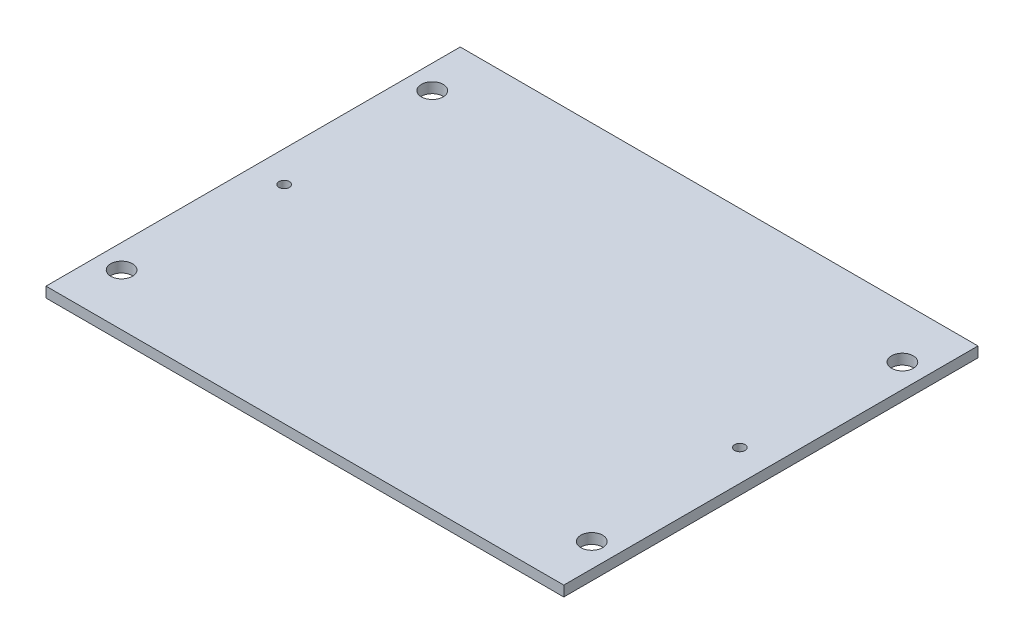
ISO-10303-21;
HEADER;
FILE_DESCRIPTION(('STEP AP214'),'2;1');
FILE_NAME('part.step','',(''),(''),'','','');
FILE_SCHEMA(('AUTOMOTIVE_DESIGN { 1 0 10303 214 1 1 1 1 }'));
ENDSEC;
DATA;
#1=APPLICATION_CONTEXT('core data for automotive mechanical design processes');
#2=APPLICATION_PROTOCOL_DEFINITION('international standard','automotive_design',2000,#1);
#3=PRODUCT_CONTEXT('',#1,'mechanical');
#4=PRODUCT('Part','Part','',(#3));
#5=PRODUCT_RELATED_PRODUCT_CATEGORY('part','',(#4));
#6=PRODUCT_DEFINITION_FORMATION('','',#4);
#7=PRODUCT_DEFINITION_CONTEXT('part definition',#1,'design');
#8=PRODUCT_DEFINITION('design','',#6,#7);
#9=PRODUCT_DEFINITION_SHAPE('','',#8);
#10=(LENGTH_UNIT() NAMED_UNIT(*) SI_UNIT(.MILLI.,.METRE.));
#11=(NAMED_UNIT(*) PLANE_ANGLE_UNIT() SI_UNIT($,.RADIAN.));
#12=(NAMED_UNIT(*) SI_UNIT($,.STERADIAN.) SOLID_ANGLE_UNIT());
#13=UNCERTAINTY_MEASURE_WITH_UNIT(LENGTH_MEASURE(1.E-05),#10,'distance_accuracy_value','');
#14=(GEOMETRIC_REPRESENTATION_CONTEXT(3) GLOBAL_UNCERTAINTY_ASSIGNED_CONTEXT((#13)) GLOBAL_UNIT_ASSIGNED_CONTEXT((#10,
#11,#12)) REPRESENTATION_CONTEXT('',''));
#15=CARTESIAN_POINT('',(0.,0.,0.));
#16=DIRECTION('',(0.,0.,1.));
#17=DIRECTION('',(1.,0.,0.));
#18=AXIS2_PLACEMENT_3D('',#15,#16,#17);
#19=CARTESIAN_POINT('',(0.,10.,0.));
#20=DIRECTION('',(0.,-1.,0.));
#21=DIRECTION('',(0.,0.,-1.));
#22=AXIS2_PLACEMENT_3D('',#19,#20,#21);
#23=PLANE('',#22);
#24=DIRECTION('',(0.,0.,-1.));
#25=VECTOR('',#24,1.);
#26=CARTESIAN_POINT('',(250.,10.,200.));
#27=LINE('',#26,#25);
#28=CARTESIAN_POINT('',(250.,10.,200.));
#29=VERTEX_POINT('',#28);
#30=CARTESIAN_POINT('',(250.,10.,-200.));
#31=VERTEX_POINT('',#30);
#32=EDGE_CURVE('E89',#29,#31,#27,.T.);
#33=ORIENTED_EDGE('',*,*,#32,.T.);
#34=DIRECTION('',(-1.,0.,0.));
#35=VECTOR('',#34,1.);
#36=CARTESIAN_POINT('',(-250.,10.,-200.));
#37=LINE('',#36,#35);
#38=CARTESIAN_POINT('',(-250.,10.,-200.));
#39=VERTEX_POINT('',#38);
#40=EDGE_CURVE('E84',#31,#39,#37,.T.);
#41=ORIENTED_EDGE('',*,*,#40,.T.);
#42=DIRECTION('',(0.,0.,1.));
#43=VECTOR('',#42,1.);
#44=CARTESIAN_POINT('',(-250.,10.,200.));
#45=LINE('',#44,#43);
#46=CARTESIAN_POINT('',(-250.,10.,200.));
#47=VERTEX_POINT('',#46);
#48=EDGE_CURVE('E87',#39,#47,#45,.T.);
#49=ORIENTED_EDGE('',*,*,#48,.T.);
#50=DIRECTION('',(1.,0.,0.));
#51=VECTOR('',#50,1.);
#52=CARTESIAN_POINT('',(-250.,10.,200.));
#53=LINE('',#52,#51);
#54=EDGE_CURVE('E54',#47,#29,#53,.T.);
#55=ORIENTED_EDGE('',*,*,#54,.T.);
#56=EDGE_LOOP('',(#33,#41,#49,#55));
#57=FACE_BOUND('',#56,.T.);
#58=CARTESIAN_POINT('',(-227.,10.,-150.));
#59=DIRECTION('',(0.,1.,0.));
#60=DIRECTION('',(0.,0.,1.));
#61=AXIS2_PLACEMENT_3D('',#58,#59,#60);
#62=CIRCLE('',#61,10.5);
#63=CARTESIAN_POINT('',(-227.,10.,-139.5));
#64=VERTEX_POINT('',#63);
#65=EDGE_CURVE('E104',#64,#64,#62,.T.);
#66=ORIENTED_EDGE('',*,*,#65,.F.);
#67=EDGE_LOOP('',(#66));
#68=FACE_BOUND('',#67,.T.);
#69=CARTESIAN_POINT('',(-227.,10.,150.));
#70=DIRECTION('',(0.,1.,0.));
#71=DIRECTION('',(0.,0.,1.));
#72=AXIS2_PLACEMENT_3D('',#69,#70,#71);
#73=CIRCLE('',#72,10.5);
#74=CARTESIAN_POINT('',(-227.,10.,160.5));
#75=VERTEX_POINT('',#74);
#76=EDGE_CURVE('E119',#75,#75,#73,.T.);
#77=ORIENTED_EDGE('',*,*,#76,.F.);
#78=EDGE_LOOP('',(#77));
#79=FACE_BOUND('',#78,.T.);
#80=CARTESIAN_POINT('',(227.,10.,150.));
#81=DIRECTION('',(0.,1.,0.));
#82=DIRECTION('',(0.,0.,1.));
#83=AXIS2_PLACEMENT_3D('',#80,#81,#82);
#84=CIRCLE('',#83,10.5);
#85=CARTESIAN_POINT('',(227.,10.,160.5));
#86=VERTEX_POINT('',#85);
#87=EDGE_CURVE('E125',#86,#86,#84,.T.);
#88=ORIENTED_EDGE('',*,*,#87,.F.);
#89=EDGE_LOOP('',(#88));
#90=FACE_BOUND('',#89,.T.);
#91=CARTESIAN_POINT('',(227.,10.,-150.));
#92=DIRECTION('',(0.,1.,0.));
#93=DIRECTION('',(0.,0.,1.));
#94=AXIS2_PLACEMENT_3D('',#91,#92,#93);
#95=CIRCLE('',#94,10.5);
#96=CARTESIAN_POINT('',(227.,10.,-139.5));
#97=VERTEX_POINT('',#96);
#98=EDGE_CURVE('E131',#97,#97,#95,.T.);
#99=ORIENTED_EDGE('',*,*,#98,.F.);
#100=EDGE_LOOP('',(#99));
#101=FACE_BOUND('',#100,.T.);
#102=CARTESIAN_POINT('',(-220.,10.,0.));
#103=DIRECTION('',(0.,1.,0.));
#104=DIRECTION('',(0.,0.,1.));
#105=AXIS2_PLACEMENT_3D('',#102,#103,#104);
#106=CIRCLE('',#105,4.99999999999999);
#107=CARTESIAN_POINT('',(-220.,10.,4.99999999999999));
#108=VERTEX_POINT('',#107);
#109=EDGE_CURVE('E137',#108,#108,#106,.T.);
#110=ORIENTED_EDGE('',*,*,#109,.F.);
#111=EDGE_LOOP('',(#110));
#112=FACE_BOUND('',#111,.T.);
#113=CARTESIAN_POINT('',(220.,10.,0.));
#114=DIRECTION('',(0.,1.,0.));
#115=DIRECTION('',(0.,0.,1.));
#116=AXIS2_PLACEMENT_3D('',#113,#114,#115);
#117=CIRCLE('',#116,4.99999999999999);
#118=CARTESIAN_POINT('',(220.,10.,4.99999999999999));
#119=VERTEX_POINT('',#118);
#120=EDGE_CURVE('E143',#119,#119,#117,.T.);
#121=ORIENTED_EDGE('',*,*,#120,.F.);
#122=EDGE_LOOP('',(#121));
#123=FACE_BOUND('',#122,.T.);
#124=ADVANCED_FACE('F37',(#57,#68,#79,#90,#101,#112,#123),#23,.F.);
#125=CARTESIAN_POINT('',(0.,0.,0.));
#126=DIRECTION('',(0.,-1.,0.));
#127=DIRECTION('',(0.,0.,-1.));
#128=AXIS2_PLACEMENT_3D('',#125,#126,#127);
#129=PLANE('',#128);
#130=CARTESIAN_POINT('',(-220.,0.,0.));
#131=DIRECTION('',(0.,1.,0.));
#132=DIRECTION('',(0.,0.,1.));
#133=AXIS2_PLACEMENT_3D('',#130,#131,#132);
#134=CIRCLE('',#133,4.99999999999999);
#135=CARTESIAN_POINT('',(-220.,0.,4.99999999999999));
#136=VERTEX_POINT('',#135);
#137=EDGE_CURVE('E140',#136,#136,#134,.T.);
#138=ORIENTED_EDGE('',*,*,#137,.T.);
#139=EDGE_LOOP('',(#138));
#140=FACE_BOUND('',#139,.T.);
#141=CARTESIAN_POINT('',(227.,0.,150.));
#142=DIRECTION('',(0.,1.,0.));
#143=DIRECTION('',(0.,0.,1.));
#144=AXIS2_PLACEMENT_3D('',#141,#142,#143);
#145=CIRCLE('',#144,10.5);
#146=CARTESIAN_POINT('',(227.,0.,160.5));
#147=VERTEX_POINT('',#146);
#148=EDGE_CURVE('E128',#147,#147,#145,.T.);
#149=ORIENTED_EDGE('',*,*,#148,.T.);
#150=EDGE_LOOP('',(#149));
#151=FACE_BOUND('',#150,.T.);
#152=CARTESIAN_POINT('',(-227.,0.,-150.));
#153=DIRECTION('',(0.,1.,0.));
#154=DIRECTION('',(0.,0.,1.));
#155=AXIS2_PLACEMENT_3D('',#152,#153,#154);
#156=CIRCLE('',#155,10.5);
#157=CARTESIAN_POINT('',(-227.,0.,-139.5));
#158=VERTEX_POINT('',#157);
#159=EDGE_CURVE('E116',#158,#158,#156,.T.);
#160=ORIENTED_EDGE('',*,*,#159,.T.);
#161=EDGE_LOOP('',(#160));
#162=FACE_BOUND('',#161,.T.);
#163=DIRECTION('',(0.,0.,-1.));
#164=VECTOR('',#163,1.);
#165=CARTESIAN_POINT('',(250.,0.,200.));
#166=LINE('',#165,#164);
#167=CARTESIAN_POINT('',(250.,0.,200.));
#168=VERTEX_POINT('',#167);
#169=CARTESIAN_POINT('',(250.,0.,-200.));
#170=VERTEX_POINT('',#169);
#171=EDGE_CURVE('E101',#168,#170,#166,.T.);
#172=ORIENTED_EDGE('',*,*,#171,.F.);
#173=DIRECTION('',(1.,0.,0.));
#174=VECTOR('',#173,1.);
#175=CARTESIAN_POINT('',(-250.,0.,200.));
#176=LINE('',#175,#174);
#177=CARTESIAN_POINT('',(-250.,0.,200.));
#178=VERTEX_POINT('',#177);
#179=EDGE_CURVE('E77',#178,#168,#176,.T.);
#180=ORIENTED_EDGE('',*,*,#179,.F.);
#181=DIRECTION('',(0.,0.,1.));
#182=VECTOR('',#181,1.);
#183=CARTESIAN_POINT('',(-250.,0.,200.));
#184=LINE('',#183,#182);
#185=CARTESIAN_POINT('',(-250.,0.,-200.));
#186=VERTEX_POINT('',#185);
#187=EDGE_CURVE('E71',#186,#178,#184,.T.);
#188=ORIENTED_EDGE('',*,*,#187,.F.);
#189=DIRECTION('',(-1.,0.,0.));
#190=VECTOR('',#189,1.);
#191=CARTESIAN_POINT('',(-250.,0.,-200.));
#192=LINE('',#191,#190);
#193=EDGE_CURVE('E93',#170,#186,#192,.T.);
#194=ORIENTED_EDGE('',*,*,#193,.F.);
#195=EDGE_LOOP('',(#172,#180,#188,#194));
#196=FACE_BOUND('',#195,.T.);
#197=CARTESIAN_POINT('',(-227.,0.,150.));
#198=DIRECTION('',(0.,1.,0.));
#199=DIRECTION('',(0.,0.,1.));
#200=AXIS2_PLACEMENT_3D('',#197,#198,#199);
#201=CIRCLE('',#200,10.5);
#202=CARTESIAN_POINT('',(-227.,0.,160.5));
#203=VERTEX_POINT('',#202);
#204=EDGE_CURVE('E122',#203,#203,#201,.T.);
#205=ORIENTED_EDGE('',*,*,#204,.T.);
#206=EDGE_LOOP('',(#205));
#207=FACE_BOUND('',#206,.T.);
#208=CARTESIAN_POINT('',(227.,0.,-150.));
#209=DIRECTION('',(0.,1.,0.));
#210=DIRECTION('',(0.,0.,1.));
#211=AXIS2_PLACEMENT_3D('',#208,#209,#210);
#212=CIRCLE('',#211,10.5);
#213=CARTESIAN_POINT('',(227.,0.,-139.5));
#214=VERTEX_POINT('',#213);
#215=EDGE_CURVE('E134',#214,#214,#212,.T.);
#216=ORIENTED_EDGE('',*,*,#215,.T.);
#217=EDGE_LOOP('',(#216));
#218=FACE_BOUND('',#217,.T.);
#219=CARTESIAN_POINT('',(220.,0.,0.));
#220=DIRECTION('',(0.,1.,0.));
#221=DIRECTION('',(0.,0.,1.));
#222=AXIS2_PLACEMENT_3D('',#219,#220,#221);
#223=CIRCLE('',#222,4.99999999999999);
#224=CARTESIAN_POINT('',(220.,0.,4.99999999999999));
#225=VERTEX_POINT('',#224);
#226=EDGE_CURVE('E146',#225,#225,#223,.T.);
#227=ORIENTED_EDGE('',*,*,#226,.T.);
#228=EDGE_LOOP('',(#227));
#229=FACE_BOUND('',#228,.T.);
#230=ADVANCED_FACE('F112',(#140,#151,#162,#196,#207,#218,#229),#129,.T.);
#231=CARTESIAN_POINT('',(250.,10.,200.));
#232=DIRECTION('',(-1.,0.,0.));
#233=DIRECTION('',(0.,0.,1.));
#234=AXIS2_PLACEMENT_3D('',#231,#232,#233);
#235=PLANE('',#234);
#236=ORIENTED_EDGE('',*,*,#171,.T.);
#237=DIRECTION('',(0.,-1.,0.));
#238=VECTOR('',#237,1.);
#239=CARTESIAN_POINT('',(250.,10.,-200.));
#240=LINE('',#239,#238);
#241=EDGE_CURVE('E11',#31,#170,#240,.T.);
#242=ORIENTED_EDGE('',*,*,#241,.F.);
#243=ORIENTED_EDGE('',*,*,#32,.F.);
#244=DIRECTION('',(0.,-1.,0.));
#245=VECTOR('',#244,1.);
#246=CARTESIAN_POINT('',(250.,10.,200.));
#247=LINE('',#246,#245);
#248=EDGE_CURVE('E97',#29,#168,#247,.T.);
#249=ORIENTED_EDGE('',*,*,#248,.T.);
#250=EDGE_LOOP('',(#236,#242,#243,#249));
#251=FACE_BOUND('',#250,.T.);
#252=ADVANCED_FACE('F39',(#251),#235,.F.);
#253=CARTESIAN_POINT('',(-250.,10.,-200.));
#254=DIRECTION('',(0.,0.,1.));
#255=DIRECTION('',(1.,0.,0.));
#256=AXIS2_PLACEMENT_3D('',#253,#254,#255);
#257=PLANE('',#256);
#258=ORIENTED_EDGE('',*,*,#193,.T.);
#259=DIRECTION('',(0.,-1.,0.));
#260=VECTOR('',#259,1.);
#261=CARTESIAN_POINT('',(-250.,10.,-200.));
#262=LINE('',#261,#260);
#263=EDGE_CURVE('E46',#39,#186,#262,.T.);
#264=ORIENTED_EDGE('',*,*,#263,.F.);
#265=ORIENTED_EDGE('',*,*,#40,.F.);
#266=ORIENTED_EDGE('',*,*,#241,.T.);
#267=EDGE_LOOP('',(#258,#264,#265,#266));
#268=FACE_BOUND('',#267,.T.);
#269=ADVANCED_FACE('F92',(#268),#257,.F.);
#270=CARTESIAN_POINT('',(-250.,10.,200.));
#271=DIRECTION('',(1.,0.,0.));
#272=DIRECTION('',(0.,0.,-1.));
#273=AXIS2_PLACEMENT_3D('',#270,#271,#272);
#274=PLANE('',#273);
#275=ORIENTED_EDGE('',*,*,#187,.T.);
#276=DIRECTION('',(0.,-1.,0.));
#277=VECTOR('',#276,1.);
#278=CARTESIAN_POINT('',(-250.,10.,200.));
#279=LINE('',#278,#277);
#280=EDGE_CURVE('E94',#47,#178,#279,.T.);
#281=ORIENTED_EDGE('',*,*,#280,.F.);
#282=ORIENTED_EDGE('',*,*,#48,.F.);
#283=ORIENTED_EDGE('',*,*,#263,.T.);
#284=EDGE_LOOP('',(#275,#281,#282,#283));
#285=FACE_BOUND('',#284,.T.);
#286=ADVANCED_FACE('F95',(#285),#274,.F.);
#287=CARTESIAN_POINT('',(-250.,10.,200.));
#288=DIRECTION('',(0.,0.,-1.));
#289=DIRECTION('',(-1.,0.,0.));
#290=AXIS2_PLACEMENT_3D('',#287,#288,#289);
#291=PLANE('',#290);
#292=ORIENTED_EDGE('',*,*,#179,.T.);
#293=ORIENTED_EDGE('',*,*,#248,.F.);
#294=ORIENTED_EDGE('',*,*,#54,.F.);
#295=ORIENTED_EDGE('',*,*,#280,.T.);
#296=EDGE_LOOP('',(#292,#293,#294,#295));
#297=FACE_BOUND('',#296,.T.);
#298=ADVANCED_FACE('F109',(#297),#291,.F.);
#299=CARTESIAN_POINT('',(-227.,10.,-150.));
#300=DIRECTION('',(0.,-1.,0.));
#301=DIRECTION('',(0.,0.,-1.));
#302=AXIS2_PLACEMENT_3D('',#299,#300,#301);
#303=CYLINDRICAL_SURFACE('',#302,10.5);
#304=ORIENTED_EDGE('',*,*,#65,.T.);
#305=EDGE_LOOP('',(#304));
#306=FACE_BOUND('',#305,.T.);
#307=ORIENTED_EDGE('',*,*,#159,.F.);
#308=EDGE_LOOP('',(#307));
#309=FACE_BOUND('',#308,.T.);
#310=ADVANCED_FACE('F163',(#306,#309),#303,.F.);
#311=CARTESIAN_POINT('',(-227.,10.,150.));
#312=DIRECTION('',(0.,-1.,0.));
#313=DIRECTION('',(0.,0.,-1.));
#314=AXIS2_PLACEMENT_3D('',#311,#312,#313);
#315=CYLINDRICAL_SURFACE('',#314,10.5);
#316=ORIENTED_EDGE('',*,*,#76,.T.);
#317=EDGE_LOOP('',(#316));
#318=FACE_BOUND('',#317,.T.);
#319=ORIENTED_EDGE('',*,*,#204,.F.);
#320=EDGE_LOOP('',(#319));
#321=FACE_BOUND('',#320,.T.);
#322=ADVANCED_FACE('F209',(#318,#321),#315,.F.);
#323=CARTESIAN_POINT('',(227.,10.,150.));
#324=DIRECTION('',(0.,-1.,0.));
#325=DIRECTION('',(0.,0.,-1.));
#326=AXIS2_PLACEMENT_3D('',#323,#324,#325);
#327=CYLINDRICAL_SURFACE('',#326,10.5);
#328=ORIENTED_EDGE('',*,*,#87,.T.);
#329=EDGE_LOOP('',(#328));
#330=FACE_BOUND('',#329,.T.);
#331=ORIENTED_EDGE('',*,*,#148,.F.);
#332=EDGE_LOOP('',(#331));
#333=FACE_BOUND('',#332,.T.);
#334=ADVANCED_FACE('F217',(#330,#333),#327,.F.);
#335=CARTESIAN_POINT('',(227.,10.,-150.));
#336=DIRECTION('',(0.,-1.,0.));
#337=DIRECTION('',(0.,0.,-1.));
#338=AXIS2_PLACEMENT_3D('',#335,#336,#337);
#339=CYLINDRICAL_SURFACE('',#338,10.5);
#340=ORIENTED_EDGE('',*,*,#98,.T.);
#341=EDGE_LOOP('',(#340));
#342=FACE_BOUND('',#341,.T.);
#343=ORIENTED_EDGE('',*,*,#215,.F.);
#344=EDGE_LOOP('',(#343));
#345=FACE_BOUND('',#344,.T.);
#346=ADVANCED_FACE('F225',(#342,#345),#339,.F.);
#347=CARTESIAN_POINT('',(-220.,10.,0.));
#348=DIRECTION('',(0.,-1.,0.));
#349=DIRECTION('',(0.,0.,-1.));
#350=AXIS2_PLACEMENT_3D('',#347,#348,#349);
#351=CYLINDRICAL_SURFACE('',#350,4.99999999999999);
#352=ORIENTED_EDGE('',*,*,#109,.T.);
#353=EDGE_LOOP('',(#352));
#354=FACE_BOUND('',#353,.T.);
#355=ORIENTED_EDGE('',*,*,#137,.F.);
#356=EDGE_LOOP('',(#355));
#357=FACE_BOUND('',#356,.T.);
#358=ADVANCED_FACE('F234',(#354,#357),#351,.F.);
#359=CARTESIAN_POINT('',(220.,10.,0.));
#360=DIRECTION('',(0.,-1.,0.));
#361=DIRECTION('',(0.,0.,-1.));
#362=AXIS2_PLACEMENT_3D('',#359,#360,#361);
#363=CYLINDRICAL_SURFACE('',#362,4.99999999999999);
#364=ORIENTED_EDGE('',*,*,#120,.T.);
#365=EDGE_LOOP('',(#364));
#366=FACE_BOUND('',#365,.T.);
#367=ORIENTED_EDGE('',*,*,#226,.F.);
#368=EDGE_LOOP('',(#367));
#369=FACE_BOUND('',#368,.T.);
#370=ADVANCED_FACE('F152',(#366,#369),#363,.F.);
#371=CLOSED_SHELL('',(#124,#230,#252,#269,#286,#298,#310,#322,#334,#346,#358,#370));
#372=MANIFOLD_SOLID_BREP('B2',#371);
#373=ADVANCED_BREP_SHAPE_REPRESENTATION('',(#18,#372),#14);
#374=SHAPE_DEFINITION_REPRESENTATION(#9,#373);
ENDSEC;
END-ISO-10303-21;
